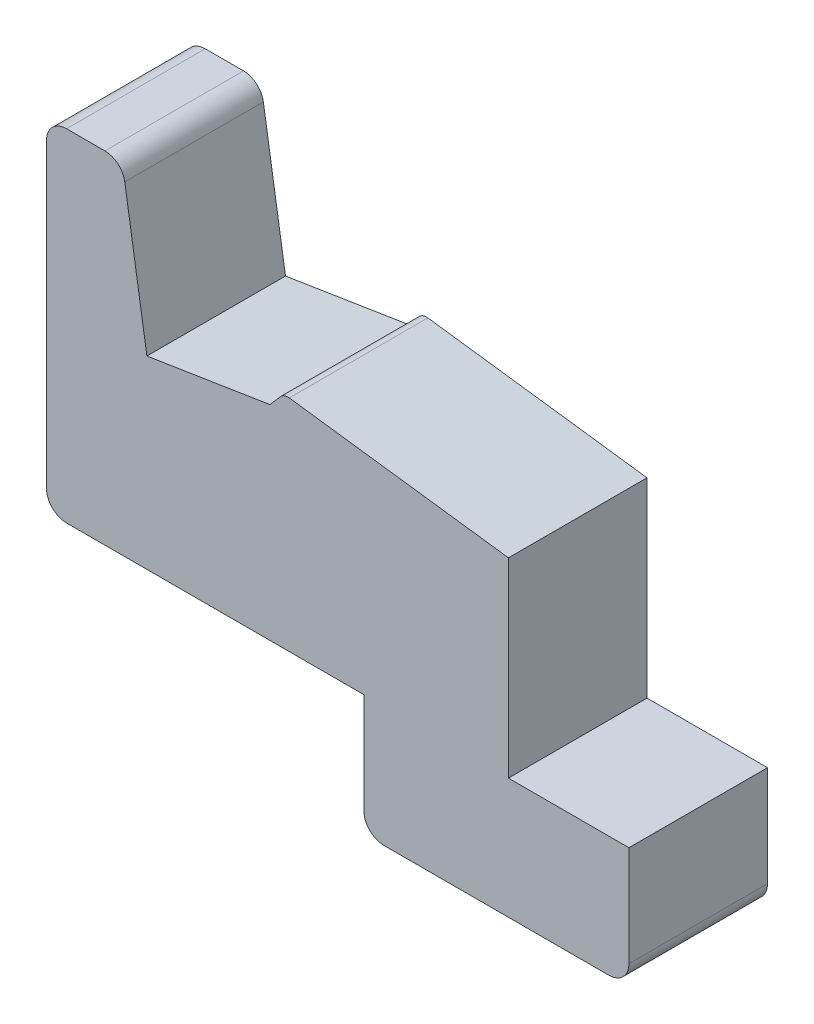
ISO-10303-21;
HEADER;
FILE_DESCRIPTION(('STEP AP214'),'2;1');
FILE_NAME('part.step','',(''),(''),'','','');
FILE_SCHEMA(('AUTOMOTIVE_DESIGN { 1 0 10303 214 1 1 1 1 }'));
ENDSEC;
DATA;
#1=APPLICATION_CONTEXT('core data for automotive mechanical design processes');
#2=APPLICATION_PROTOCOL_DEFINITION('international standard','automotive_design',2000,#1);
#3=PRODUCT_CONTEXT('',#1,'mechanical');
#4=PRODUCT('Part','Part','',(#3));
#5=PRODUCT_RELATED_PRODUCT_CATEGORY('part','',(#4));
#6=PRODUCT_DEFINITION_FORMATION('','',#4);
#7=PRODUCT_DEFINITION_CONTEXT('part definition',#1,'design');
#8=PRODUCT_DEFINITION('design','',#6,#7);
#9=PRODUCT_DEFINITION_SHAPE('','',#8);
#10=(LENGTH_UNIT() NAMED_UNIT(*) SI_UNIT(.MILLI.,.METRE.));
#11=(NAMED_UNIT(*) PLANE_ANGLE_UNIT() SI_UNIT($,.RADIAN.));
#12=(NAMED_UNIT(*) SI_UNIT($,.STERADIAN.) SOLID_ANGLE_UNIT());
#13=UNCERTAINTY_MEASURE_WITH_UNIT(LENGTH_MEASURE(1.E-05),#10,'distance_accuracy_value','');
#14=(GEOMETRIC_REPRESENTATION_CONTEXT(3) GLOBAL_UNCERTAINTY_ASSIGNED_CONTEXT((#13)) GLOBAL_UNIT_ASSIGNED_CONTEXT((#10,
#11,#12)) REPRESENTATION_CONTEXT('',''));
#15=CARTESIAN_POINT('',(0.,0.,0.));
#16=DIRECTION('',(0.,0.,1.));
#17=DIRECTION('',(1.,0.,0.));
#18=AXIS2_PLACEMENT_3D('',#15,#16,#17);
#19=CARTESIAN_POINT('',(-11.5,8.5,6.9));
#20=DIRECTION('',(1.,0.,0.));
#21=DIRECTION('',(0.,1.,0.));
#22=AXIS2_PLACEMENT_3D('',#19,#20,#21);
#23=PLANE('',#22);
#24=DIRECTION('',(0.,-1.,0.));
#25=VECTOR('',#24,1.);
#26=CARTESIAN_POINT('',(-11.5,8.5,6.9));
#27=LINE('',#26,#25);
#28=CARTESIAN_POINT('',(-11.5,7.5,6.9));
#29=VERTEX_POINT('',#28);
#30=CARTESIAN_POINT('',(-11.5,-7.5,6.9));
#31=VERTEX_POINT('',#30);
#32=EDGE_CURVE('E367',#29,#31,#27,.T.);
#33=ORIENTED_EDGE('',*,*,#32,.F.);
#34=DIRECTION('',(0.,0.,-1.));
#35=VECTOR('',#34,1.);
#36=CARTESIAN_POINT('',(-11.5,7.5,6.9));
#37=LINE('',#36,#35);
#38=CARTESIAN_POINT('',(-11.5,7.5,0.));
#39=VERTEX_POINT('',#38);
#40=EDGE_CURVE('E282',#29,#39,#37,.T.);
#41=ORIENTED_EDGE('',*,*,#40,.T.);
#42=DIRECTION('',(0.,-1.,0.));
#43=VECTOR('',#42,1.);
#44=CARTESIAN_POINT('',(-11.5,8.5,0.));
#45=LINE('',#44,#43);
#46=CARTESIAN_POINT('',(-11.5,-7.5,0.));
#47=VERTEX_POINT('',#46);
#48=EDGE_CURVE('E210',#39,#47,#45,.T.);
#49=ORIENTED_EDGE('',*,*,#48,.T.);
#50=DIRECTION('',(0.,0.,-1.));
#51=VECTOR('',#50,1.);
#52=CARTESIAN_POINT('',(-11.5,-7.5,6.9));
#53=LINE('',#52,#51);
#54=EDGE_CURVE('E383',#47,#31,#53,.F.);
#55=ORIENTED_EDGE('',*,*,#54,.T.);
#56=EDGE_LOOP('',(#33,#41,#49,#55));
#57=FACE_BOUND('',#56,.T.);
#58=ADVANCED_FACE('F38',(#57),#23,.F.);
#59=CARTESIAN_POINT('',(11.5,-8.49999999999999,6.9));
#60=DIRECTION('',(0.,1.,0.));
#61=DIRECTION('',(-1.,0.,0.));
#62=AXIS2_PLACEMENT_3D('',#59,#60,#61);
#63=PLANE('',#62);
#64=DIRECTION('',(1.,0.,0.));
#65=VECTOR('',#64,1.);
#66=CARTESIAN_POINT('',(11.5,-8.49999999999999,6.9));
#67=LINE('',#66,#65);
#68=CARTESIAN_POINT('',(-10.5,-8.5,6.9));
#69=VERTEX_POINT('',#68);
#70=CARTESIAN_POINT('',(4.3,-8.5,6.9));
#71=VERTEX_POINT('',#70);
#72=EDGE_CURVE('E291',#69,#71,#67,.T.);
#73=ORIENTED_EDGE('',*,*,#72,.F.);
#74=DIRECTION('',(0.,0.,-1.));
#75=VECTOR('',#74,1.);
#76=CARTESIAN_POINT('',(-10.5,-8.5,6.9));
#77=LINE('',#76,#75);
#78=CARTESIAN_POINT('',(-10.5,-8.5,0.));
#79=VERTEX_POINT('',#78);
#80=EDGE_CURVE('E11',#69,#79,#77,.T.);
#81=ORIENTED_EDGE('',*,*,#80,.T.);
#82=DIRECTION('',(1.,0.,0.));
#83=VECTOR('',#82,1.);
#84=CARTESIAN_POINT('',(11.5,-8.49999999999999,0.));
#85=LINE('',#84,#83);
#86=CARTESIAN_POINT('',(4.3,-8.5,0.));
#87=VERTEX_POINT('',#86);
#88=EDGE_CURVE('E200',#79,#87,#85,.T.);
#89=ORIENTED_EDGE('',*,*,#88,.T.);
#90=DIRECTION('',(0.,0.,1.));
#91=VECTOR('',#90,1.);
#92=CARTESIAN_POINT('',(4.3,-8.5,-14.4996551683135));
#93=LINE('',#92,#91);
#94=EDGE_CURVE('E205',#87,#71,#93,.T.);
#95=ORIENTED_EDGE('',*,*,#94,.T.);
#96=EDGE_LOOP('',(#73,#81,#89,#95));
#97=FACE_BOUND('',#96,.T.);
#98=ADVANCED_FACE('F203',(#97),#63,.F.);
#99=CARTESIAN_POINT('',(11.5,8.50000000000001,6.9));
#100=DIRECTION('',(-1.,0.,0.));
#101=DIRECTION('',(0.,-1.,0.));
#102=AXIS2_PLACEMENT_3D('',#99,#100,#101);
#103=PLANE('',#102);
#104=DIRECTION('',(0.,1.,0.));
#105=VECTOR('',#104,1.);
#106=CARTESIAN_POINT('',(11.5,8.50000000000001,0.));
#107=LINE('',#106,#105);
#108=CARTESIAN_POINT('',(11.5,-8.5,0.));
#109=VERTEX_POINT('',#108);
#110=CARTESIAN_POINT('',(11.5,1.,0.));
#111=VERTEX_POINT('',#110);
#112=EDGE_CURVE('E209',#109,#111,#107,.T.);
#113=ORIENTED_EDGE('',*,*,#112,.T.);
#114=DIRECTION('',(0.,0.,-1.));
#115=VECTOR('',#114,1.);
#116=CARTESIAN_POINT('',(11.5,1.,62.5890617273248));
#117=LINE('',#116,#115);
#118=CARTESIAN_POINT('',(11.5,1.,6.9));
#119=VERTEX_POINT('',#118);
#120=EDGE_CURVE('E420',#119,#111,#117,.T.);
#121=ORIENTED_EDGE('',*,*,#120,.F.);
#122=DIRECTION('',(0.,1.,0.));
#123=VECTOR('',#122,1.);
#124=CARTESIAN_POINT('',(11.5,8.50000000000001,6.9));
#125=LINE('',#124,#123);
#126=CARTESIAN_POINT('',(11.5,-8.5,6.9));
#127=VERTEX_POINT('',#126);
#128=EDGE_CURVE('E316',#127,#119,#125,.T.);
#129=ORIENTED_EDGE('',*,*,#128,.F.);
#130=DIRECTION('',(0.,0.,-1.));
#131=VECTOR('',#130,1.);
#132=CARTESIAN_POINT('',(11.5,-8.49999999999999,6.9));
#133=LINE('',#132,#131);
#134=EDGE_CURVE('E304',#127,#109,#133,.T.);
#135=ORIENTED_EDGE('',*,*,#134,.T.);
#136=EDGE_LOOP('',(#113,#121,#129,#135));
#137=FACE_BOUND('',#136,.T.);
#138=ADVANCED_FACE('F439',(#137),#103,.F.);
#139=CARTESIAN_POINT('',(11.5,8.50000000000001,6.9));
#140=DIRECTION('',(0.,-1.,0.));
#141=DIRECTION('',(1.,0.,0.));
#142=AXIS2_PLACEMENT_3D('',#139,#140,#141);
#143=PLANE('',#142);
#144=DIRECTION('',(-1.,0.,0.));
#145=VECTOR('',#144,1.);
#146=CARTESIAN_POINT('',(11.5,8.50000000000001,6.9));
#147=LINE('',#146,#145);
#148=CARTESIAN_POINT('',(-8.5894793199948,8.5,6.9));
#149=VERTEX_POINT('',#148);
#150=CARTESIAN_POINT('',(-10.5,8.5,6.9));
#151=VERTEX_POINT('',#150);
#152=EDGE_CURVE('E309',#149,#151,#147,.T.);
#153=ORIENTED_EDGE('',*,*,#152,.F.);
#154=DIRECTION('',(0.,0.,-1.));
#155=VECTOR('',#154,1.);
#156=CARTESIAN_POINT('',(-8.5894793199948,8.5,6.9));
#157=LINE('',#156,#155);
#158=CARTESIAN_POINT('',(-8.5894793199948,8.5,0.));
#159=VERTEX_POINT('',#158);
#160=EDGE_CURVE('E352',#149,#159,#157,.T.);
#161=ORIENTED_EDGE('',*,*,#160,.T.);
#162=DIRECTION('',(-1.,0.,0.));
#163=VECTOR('',#162,1.);
#164=CARTESIAN_POINT('',(11.5,8.50000000000001,0.));
#165=LINE('',#164,#163);
#166=CARTESIAN_POINT('',(-10.5,8.5,0.));
#167=VERTEX_POINT('',#166);
#168=EDGE_CURVE('E301',#159,#167,#165,.T.);
#169=ORIENTED_EDGE('',*,*,#168,.T.);
#170=DIRECTION('',(0.,0.,-1.));
#171=VECTOR('',#170,1.);
#172=CARTESIAN_POINT('',(-10.5,8.5,6.9));
#173=LINE('',#172,#171);
#174=EDGE_CURVE('E349',#167,#151,#173,.F.);
#175=ORIENTED_EDGE('',*,*,#174,.T.);
#176=EDGE_LOOP('',(#153,#161,#169,#175));
#177=FACE_BOUND('',#176,.T.);
#178=ADVANCED_FACE('F425',(#177),#143,.F.);
#179=CARTESIAN_POINT('',(0.,0.,6.9));
#180=DIRECTION('',(0.,0.,-1.));
#181=DIRECTION('',(-1.,0.,0.));
#182=AXIS2_PLACEMENT_3D('',#179,#180,#181);
#183=PLANE('',#182);
#184=DIRECTION('',(-0.156434465040224,0.987688340595139,0.));
#185=VECTOR('',#184,1.);
#186=CARTESIAN_POINT('',(-6.23277772992803,-0.987175012421843,6.9));
#187=LINE('',#186,#185);
#188=CARTESIAN_POINT('',(-6.5,0.700000000000001,6.9));
#189=VERTEX_POINT('',#188);
#190=CARTESIAN_POINT('',(-7.60179097939966,7.65643446504023,6.9));
#191=VERTEX_POINT('',#190);
#192=EDGE_CURVE('E412',#189,#191,#187,.T.);
#193=ORIENTED_EDGE('',*,*,#192,.T.);
#194=CARTESIAN_POINT('',(-8.5894793199948,7.5,6.9));
#195=DIRECTION('',(0.,0.,-1.));
#196=DIRECTION('',(-1.,0.,0.));
#197=AXIS2_PLACEMENT_3D('',#194,#195,#196);
#198=CIRCLE('',#197,1.);
#199=EDGE_CURVE('E380',#191,#149,#198,.F.);
#200=ORIENTED_EDGE('',*,*,#199,.T.);
#201=ORIENTED_EDGE('',*,*,#152,.T.);
#202=CARTESIAN_POINT('',(-10.5,7.5,6.9));
#203=DIRECTION('',(0.,0.,-1.));
#204=DIRECTION('',(-1.,0.,0.));
#205=AXIS2_PLACEMENT_3D('',#202,#203,#204);
#206=CIRCLE('',#205,1.);
#207=EDGE_CURVE('E378',#151,#29,#206,.F.);
#208=ORIENTED_EDGE('',*,*,#207,.T.);
#209=ORIENTED_EDGE('',*,*,#32,.T.);
#210=CARTESIAN_POINT('',(-10.5,-7.5,6.9));
#211=DIRECTION('',(0.,0.,-1.));
#212=DIRECTION('',(-1.,0.,0.));
#213=AXIS2_PLACEMENT_3D('',#210,#211,#212);
#214=CIRCLE('',#213,1.);
#215=EDGE_CURVE('E374',#31,#69,#214,.F.);
#216=ORIENTED_EDGE('',*,*,#215,.T.);
#217=ORIENTED_EDGE('',*,*,#72,.T.);
#218=DIRECTION('',(0.,-1.,0.));
#219=VECTOR('',#218,1.);
#220=CARTESIAN_POINT('',(4.3,-8.5,6.9));
#221=LINE('',#220,#219);
#222=CARTESIAN_POINT('',(4.3,-13.5,6.9));
#223=VERTEX_POINT('',#222);
#224=EDGE_CURVE('E228',#71,#223,#221,.T.);
#225=ORIENTED_EDGE('',*,*,#224,.T.);
#226=CARTESIAN_POINT('',(5.3,-13.5,6.9));
#227=DIRECTION('',(0.,0.,-1.));
#228=DIRECTION('',(-1.,0.,0.));
#229=AXIS2_PLACEMENT_3D('',#226,#227,#228);
#230=CIRCLE('',#229,1.);
#231=CARTESIAN_POINT('',(5.3,-14.5,6.9));
#232=VERTEX_POINT('',#231);
#233=EDGE_CURVE('E290',#223,#232,#230,.F.);
#234=ORIENTED_EDGE('',*,*,#233,.T.);
#235=DIRECTION('',(1.,0.,0.));
#236=VECTOR('',#235,1.);
#237=CARTESIAN_POINT('',(17.5,-14.5,6.9));
#238=LINE('',#237,#236);
#239=CARTESIAN_POINT('',(16.5,-14.5,6.9));
#240=VERTEX_POINT('',#239);
#241=EDGE_CURVE('E234',#232,#240,#238,.T.);
#242=ORIENTED_EDGE('',*,*,#241,.T.);
#243=CARTESIAN_POINT('',(16.5,-13.5,6.9));
#244=DIRECTION('',(0.,0.,-1.));
#245=DIRECTION('',(-1.,0.,0.));
#246=AXIS2_PLACEMENT_3D('',#243,#244,#245);
#247=CIRCLE('',#246,1.);
#248=CARTESIAN_POINT('',(17.5,-13.5,6.9));
#249=VERTEX_POINT('',#248);
#250=EDGE_CURVE('E57',#240,#249,#247,.F.);
#251=ORIENTED_EDGE('',*,*,#250,.T.);
#252=DIRECTION('',(0.,1.,0.));
#253=VECTOR('',#252,1.);
#254=CARTESIAN_POINT('',(17.5,-8.5,6.9));
#255=LINE('',#254,#253);
#256=CARTESIAN_POINT('',(17.5,-8.5,6.9));
#257=VERTEX_POINT('',#256);
#258=EDGE_CURVE('E256',#249,#257,#255,.T.);
#259=ORIENTED_EDGE('',*,*,#258,.T.);
#260=DIRECTION('',(-1.,0.,0.));
#261=VECTOR('',#260,1.);
#262=CARTESIAN_POINT('',(17.5,-8.5,6.9));
#263=LINE('',#262,#261);
#264=EDGE_CURVE('E251',#257,#127,#263,.T.);
#265=ORIENTED_EDGE('',*,*,#264,.T.);
#266=ORIENTED_EDGE('',*,*,#128,.T.);
#267=DIRECTION('',(-0.991427261327905,0.130659808265013,0.));
#268=VECTOR('',#267,1.);
#269=CARTESIAN_POINT('',(0.325867529076084,2.47263451705297,6.9));
#270=LINE('',#269,#268);
#271=CARTESIAN_POINT('',(0.588330279591154,2.43804465454196,6.9));
#272=VERTEX_POINT('',#271);
#273=EDGE_CURVE('E618',#119,#272,#270,.T.);
#274=ORIENTED_EDGE('',*,*,#273,.T.);
#275=CARTESIAN_POINT('',(0.523000375458647,1.942331023878,6.9));
#276=DIRECTION('',(0.,0.,-1.));
#277=DIRECTION('',(-1.,0.,0.));
#278=AXIS2_PLACEMENT_3D('',#275,#276,#277);
#279=CIRCLE('',#278,0.5);
#280=CARTESIAN_POINT('',(0.145645585347263,2.27036053837326,6.9));
#281=VERTEX_POINT('',#280);
#282=EDGE_CURVE('E346',#272,#281,#279,.F.);
#283=ORIENTED_EDGE('',*,*,#282,.T.);
#284=DIRECTION('',(-0.656059028990511,-0.754709580222769,0.));
#285=VECTOR('',#284,1.);
#286=CARTESIAN_POINT('',(-1.04117500629039,0.90507962471397,6.9));
#287=LINE('',#286,#285);
#288=CARTESIAN_POINT('',(-0.376332288310136,1.66989368324939,6.9));
#289=VERTEX_POINT('',#288);
#290=EDGE_CURVE('E630',#281,#289,#287,.T.);
#291=ORIENTED_EDGE('',*,*,#290,.T.);
#292=DIRECTION('',(-0.987688340595139,-0.156434465040224,0.));
#293=VECTOR('',#292,1.);
#294=CARTESIAN_POINT('',(-0.267222270071965,1.68717501242184,6.9));
#295=LINE('',#294,#293);
#296=EDGE_CURVE('E418',#289,#189,#295,.T.);
#297=ORIENTED_EDGE('',*,*,#296,.T.);
#298=EDGE_LOOP('',(#193,#200,#201,#208,#209,#216,#217,#225,#234,#242,#251,#259,#265,#266,#274,
#283,#291,#297));
#299=FACE_BOUND('',#298,.T.);
#300=ADVANCED_FACE('F289',(#299),#183,.F.);
#301=CARTESIAN_POINT('',(0.,0.,0.));
#302=DIRECTION('',(0.,0.,-1.));
#303=DIRECTION('',(-1.,0.,0.));
#304=AXIS2_PLACEMENT_3D('',#301,#302,#303);
#305=PLANE('',#304);
#306=ORIENTED_EDGE('',*,*,#168,.F.);
#307=CARTESIAN_POINT('',(-8.5894793199948,7.5,0.));
#308=DIRECTION('',(0.,0.,-1.));
#309=DIRECTION('',(-1.,0.,0.));
#310=AXIS2_PLACEMENT_3D('',#307,#308,#309);
#311=CIRCLE('',#310,1.);
#312=CARTESIAN_POINT('',(-7.60179097939966,7.65643446504023,0.));
#313=VERTEX_POINT('',#312);
#314=EDGE_CURVE('E403',#159,#313,#311,.T.);
#315=ORIENTED_EDGE('',*,*,#314,.T.);
#316=DIRECTION('',(-0.156434465040224,0.987688340595139,0.));
#317=VECTOR('',#316,1.);
#318=CARTESIAN_POINT('',(-6.23277772992803,-0.987175012421843,0.));
#319=LINE('',#318,#317);
#320=CARTESIAN_POINT('',(-6.5,0.700000000000001,0.));
#321=VERTEX_POINT('',#320);
#322=EDGE_CURVE('E308',#321,#313,#319,.T.);
#323=ORIENTED_EDGE('',*,*,#322,.F.);
#324=DIRECTION('',(-0.987688340595139,-0.156434465040224,0.));
#325=VECTOR('',#324,1.);
#326=CARTESIAN_POINT('',(-0.267222270071965,1.68717501242184,0.));
#327=LINE('',#326,#325);
#328=CARTESIAN_POINT('',(-0.376332288310136,1.66989368324939,0.));
#329=VERTEX_POINT('',#328);
#330=EDGE_CURVE('E325',#329,#321,#327,.T.);
#331=ORIENTED_EDGE('',*,*,#330,.F.);
#332=DIRECTION('',(-0.656059028990511,-0.754709580222769,0.));
#333=VECTOR('',#332,1.);
#334=CARTESIAN_POINT('',(-1.04117500629039,0.90507962471397,0.));
#335=LINE('',#334,#333);
#336=CARTESIAN_POINT('',(0.145645585347263,2.27036053837326,0.));
#337=VERTEX_POINT('',#336);
#338=EDGE_CURVE('E329',#337,#329,#335,.T.);
#339=ORIENTED_EDGE('',*,*,#338,.F.);
#340=CARTESIAN_POINT('',(0.523000375458647,1.942331023878,0.));
#341=DIRECTION('',(0.,0.,-1.));
#342=DIRECTION('',(-1.,0.,0.));
#343=AXIS2_PLACEMENT_3D('',#340,#341,#342);
#344=CIRCLE('',#343,0.5);
#345=CARTESIAN_POINT('',(0.588330279591154,2.43804465454196,0.));
#346=VERTEX_POINT('',#345);
#347=EDGE_CURVE('E340',#337,#346,#344,.T.);
#348=ORIENTED_EDGE('',*,*,#347,.T.);
#349=DIRECTION('',(-0.991427261327905,0.130659808265013,0.));
#350=VECTOR('',#349,1.);
#351=CARTESIAN_POINT('',(0.325867529076084,2.47263451705297,0.));
#352=LINE('',#351,#350);
#353=EDGE_CURVE('E332',#111,#346,#352,.T.);
#354=ORIENTED_EDGE('',*,*,#353,.F.);
#355=ORIENTED_EDGE('',*,*,#112,.F.);
#356=DIRECTION('',(-1.,0.,0.));
#357=VECTOR('',#356,1.);
#358=CARTESIAN_POINT('',(17.5,-8.5,0.));
#359=LINE('',#358,#357);
#360=CARTESIAN_POINT('',(17.5,-8.5,0.));
#361=VERTEX_POINT('',#360);
#362=EDGE_CURVE('E230',#361,#109,#359,.T.);
#363=ORIENTED_EDGE('',*,*,#362,.F.);
#364=DIRECTION('',(0.,1.,0.));
#365=VECTOR('',#364,1.);
#366=CARTESIAN_POINT('',(17.5,-8.5,0.));
#367=LINE('',#366,#365);
#368=CARTESIAN_POINT('',(17.5,-13.5,0.));
#369=VERTEX_POINT('',#368);
#370=EDGE_CURVE('E248',#369,#361,#367,.T.);
#371=ORIENTED_EDGE('',*,*,#370,.F.);
#372=CARTESIAN_POINT('',(16.5,-13.5,0.));
#373=DIRECTION('',(0.,0.,-1.));
#374=DIRECTION('',(-1.,0.,0.));
#375=AXIS2_PLACEMENT_3D('',#372,#373,#374);
#376=CIRCLE('',#375,1.);
#377=CARTESIAN_POINT('',(16.5,-14.5,0.));
#378=VERTEX_POINT('',#377);
#379=EDGE_CURVE('E275',#369,#378,#376,.T.);
#380=ORIENTED_EDGE('',*,*,#379,.T.);
#381=DIRECTION('',(1.,0.,0.));
#382=VECTOR('',#381,1.);
#383=CARTESIAN_POINT('',(17.5,-14.5,0.));
#384=LINE('',#383,#382);
#385=CARTESIAN_POINT('',(5.3,-14.5,0.));
#386=VERTEX_POINT('',#385);
#387=EDGE_CURVE('E223',#386,#378,#384,.T.);
#388=ORIENTED_EDGE('',*,*,#387,.F.);
#389=CARTESIAN_POINT('',(5.3,-13.5,0.));
#390=DIRECTION('',(0.,0.,-1.));
#391=DIRECTION('',(-1.,0.,0.));
#392=AXIS2_PLACEMENT_3D('',#389,#390,#391);
#393=CIRCLE('',#392,1.);
#394=CARTESIAN_POINT('',(4.3,-13.5,0.));
#395=VERTEX_POINT('',#394);
#396=EDGE_CURVE('E218',#386,#395,#393,.T.);
#397=ORIENTED_EDGE('',*,*,#396,.T.);
#398=DIRECTION('',(0.,-1.,0.));
#399=VECTOR('',#398,1.);
#400=CARTESIAN_POINT('',(4.3,-8.5,0.));
#401=LINE('',#400,#399);
#402=EDGE_CURVE('E213',#87,#395,#401,.T.);
#403=ORIENTED_EDGE('',*,*,#402,.F.);
#404=ORIENTED_EDGE('',*,*,#88,.F.);
#405=CARTESIAN_POINT('',(-10.5,-7.5,0.));
#406=DIRECTION('',(0.,0.,-1.));
#407=DIRECTION('',(-1.,0.,0.));
#408=AXIS2_PLACEMENT_3D('',#405,#406,#407);
#409=CIRCLE('',#408,1.);
#410=EDGE_CURVE('E355',#79,#47,#409,.T.);
#411=ORIENTED_EDGE('',*,*,#410,.T.);
#412=ORIENTED_EDGE('',*,*,#48,.F.);
#413=CARTESIAN_POINT('',(-10.5,7.5,0.));
#414=DIRECTION('',(0.,0.,-1.));
#415=DIRECTION('',(-1.,0.,0.));
#416=AXIS2_PLACEMENT_3D('',#413,#414,#415);
#417=CIRCLE('',#416,1.);
#418=EDGE_CURVE('E397',#39,#167,#417,.T.);
#419=ORIENTED_EDGE('',*,*,#418,.T.);
#420=EDGE_LOOP('',(#306,#315,#323,#331,#339,#348,#354,#355,#363,#371,#380,#388,#397,#403,#404,
#411,#412,#419));
#421=FACE_BOUND('',#420,.T.);
#422=ADVANCED_FACE('F215',(#421),#305,.T.);
#423=CARTESIAN_POINT('',(17.5,-8.5,-14.4996551683135));
#424=DIRECTION('',(0.,1.,0.));
#425=DIRECTION('',(-1.,0.,0.));
#426=AXIS2_PLACEMENT_3D('',#423,#424,#425);
#427=PLANE('',#426);
#428=ORIENTED_EDGE('',*,*,#134,.F.);
#429=ORIENTED_EDGE('',*,*,#264,.F.);
#430=DIRECTION('',(0.,0.,1.));
#431=VECTOR('',#430,1.);
#432=CARTESIAN_POINT('',(17.5,-8.5,-14.4996551683135));
#433=LINE('',#432,#431);
#434=EDGE_CURVE('E245',#361,#257,#433,.T.);
#435=ORIENTED_EDGE('',*,*,#434,.F.);
#436=ORIENTED_EDGE('',*,*,#362,.T.);
#437=EDGE_LOOP('',(#428,#429,#435,#436));
#438=FACE_BOUND('',#437,.T.);
#439=ADVANCED_FACE('F543',(#438),#427,.T.);
#440=CARTESIAN_POINT('',(4.3,-8.5,-14.4996551683135));
#441=DIRECTION('',(-1.,0.,0.));
#442=DIRECTION('',(0.,-1.,0.));
#443=AXIS2_PLACEMENT_3D('',#440,#441,#442);
#444=PLANE('',#443);
#445=ORIENTED_EDGE('',*,*,#402,.T.);
#446=DIRECTION('',(0.,0.,1.));
#447=VECTOR('',#446,1.);
#448=CARTESIAN_POINT('',(4.3,-13.5,-14.4996551683135));
#449=LINE('',#448,#447);
#450=EDGE_CURVE('E47',#395,#223,#449,.T.);
#451=ORIENTED_EDGE('',*,*,#450,.T.);
#452=ORIENTED_EDGE('',*,*,#224,.F.);
#453=ORIENTED_EDGE('',*,*,#94,.F.);
#454=EDGE_LOOP('',(#445,#451,#452,#453));
#455=FACE_BOUND('',#454,.T.);
#456=ADVANCED_FACE('F226',(#455),#444,.T.);
#457=CARTESIAN_POINT('',(17.5,-14.5,-14.4996551683135));
#458=DIRECTION('',(0.,-1.,0.));
#459=DIRECTION('',(1.,0.,0.));
#460=AXIS2_PLACEMENT_3D('',#457,#458,#459);
#461=PLANE('',#460);
#462=ORIENTED_EDGE('',*,*,#387,.T.);
#463=DIRECTION('',(0.,0.,1.));
#464=VECTOR('',#463,1.);
#465=CARTESIAN_POINT('',(16.5,-14.5,-14.4996551683135));
#466=LINE('',#465,#464);
#467=EDGE_CURVE('E270',#378,#240,#466,.T.);
#468=ORIENTED_EDGE('',*,*,#467,.T.);
#469=ORIENTED_EDGE('',*,*,#241,.F.);
#470=DIRECTION('',(0.,0.,1.));
#471=VECTOR('',#470,1.);
#472=CARTESIAN_POINT('',(5.3,-14.5,-14.4996551683135));
#473=LINE('',#472,#471);
#474=EDGE_CURVE('E272',#232,#386,#473,.F.);
#475=ORIENTED_EDGE('',*,*,#474,.T.);
#476=EDGE_LOOP('',(#462,#468,#469,#475));
#477=FACE_BOUND('',#476,.T.);
#478=ADVANCED_FACE('F268',(#477),#461,.T.);
#479=CARTESIAN_POINT('',(17.5,-8.5,-14.4996551683135));
#480=DIRECTION('',(1.,0.,0.));
#481=DIRECTION('',(0.,0.,-1.));
#482=AXIS2_PLACEMENT_3D('',#479,#480,#481);
#483=PLANE('',#482);
#484=ORIENTED_EDGE('',*,*,#258,.F.);
#485=DIRECTION('',(0.,0.,1.));
#486=VECTOR('',#485,1.);
#487=CARTESIAN_POINT('',(17.5,-13.5,-14.4996551683135));
#488=LINE('',#487,#486);
#489=EDGE_CURVE('E277',#249,#369,#488,.F.);
#490=ORIENTED_EDGE('',*,*,#489,.T.);
#491=ORIENTED_EDGE('',*,*,#370,.T.);
#492=ORIENTED_EDGE('',*,*,#434,.T.);
#493=EDGE_LOOP('',(#484,#490,#491,#492));
#494=FACE_BOUND('',#493,.T.);
#495=ADVANCED_FACE('F520',(#494),#483,.T.);
#496=CARTESIAN_POINT('',(11.5,1.,62.5890617273248));
#497=DIRECTION('',(-0.130659808265013,-0.991427261327905,0.));
#498=DIRECTION('',(0.991427261327905,-0.130659808265013,0.));
#499=AXIS2_PLACEMENT_3D('',#496,#497,#498);
#500=PLANE('',#499);
#501=ORIENTED_EDGE('',*,*,#353,.T.);
#502=DIRECTION('',(0.,0.,-1.));
#503=VECTOR('',#502,1.);
#504=CARTESIAN_POINT('',(0.588330279591156,2.43804465454196,62.5890617273248));
#505=LINE('',#504,#503);
#506=EDGE_CURVE('E343',#346,#272,#505,.F.);
#507=ORIENTED_EDGE('',*,*,#506,.T.);
#508=ORIENTED_EDGE('',*,*,#273,.F.);
#509=ORIENTED_EDGE('',*,*,#120,.T.);
#510=EDGE_LOOP('',(#501,#507,#508,#509));
#511=FACE_BOUND('',#510,.T.);
#512=ADVANCED_FACE('F512',(#511),#500,.F.);
#513=CARTESIAN_POINT('',(0.321930688514025,2.47315335172,62.5890617273248));
#514=DIRECTION('',(0.754709580222769,-0.656059028990511,0.));
#515=DIRECTION('',(0.656059028990511,0.754709580222769,0.));
#516=AXIS2_PLACEMENT_3D('',#513,#514,#515);
#517=PLANE('',#516);
#518=ORIENTED_EDGE('',*,*,#290,.F.);
#519=DIRECTION('',(0.,0.,-1.));
#520=VECTOR('',#519,1.);
#521=CARTESIAN_POINT('',(0.145645585347263,2.27036053837326,62.5890617273248));
#522=LINE('',#521,#520);
#523=EDGE_CURVE('E336',#281,#337,#522,.T.);
#524=ORIENTED_EDGE('',*,*,#523,.T.);
#525=ORIENTED_EDGE('',*,*,#338,.T.);
#526=DIRECTION('',(0.,0.,-1.));
#527=VECTOR('',#526,1.);
#528=CARTESIAN_POINT('',(-0.376332288310136,1.66989368324939,62.5890617273248));
#529=LINE('',#528,#527);
#530=EDGE_CURVE('E620',#289,#329,#529,.T.);
#531=ORIENTED_EDGE('',*,*,#530,.F.);
#532=EDGE_LOOP('',(#518,#524,#525,#531));
#533=FACE_BOUND('',#532,.T.);
#534=ADVANCED_FACE('F502',(#533),#517,.F.);
#535=CARTESIAN_POINT('',(-0.376332288310136,1.66989368324939,62.5890617273248));
#536=DIRECTION('',(0.156434465040224,-0.987688340595139,0.));
#537=DIRECTION('',(0.987688340595139,0.156434465040224,0.));
#538=AXIS2_PLACEMENT_3D('',#535,#536,#537);
#539=PLANE('',#538);
#540=ORIENTED_EDGE('',*,*,#296,.F.);
#541=ORIENTED_EDGE('',*,*,#530,.T.);
#542=ORIENTED_EDGE('',*,*,#330,.T.);
#543=DIRECTION('',(0.,0.,-1.));
#544=VECTOR('',#543,1.);
#545=CARTESIAN_POINT('',(-6.5,0.700000000000001,62.5890617273248));
#546=LINE('',#545,#544);
#547=EDGE_CURVE('E625',#189,#321,#546,.T.);
#548=ORIENTED_EDGE('',*,*,#547,.F.);
#549=EDGE_LOOP('',(#540,#541,#542,#548));
#550=FACE_BOUND('',#549,.T.);
#551=ADVANCED_FACE('F493',(#550),#539,.F.);
#552=CARTESIAN_POINT('',(-6.5,0.700000000000001,62.5890617273248));
#553=DIRECTION('',(-0.987688340595139,-0.156434465040224,0.));
#554=DIRECTION('',(0.156434465040224,-0.987688340595139,0.));
#555=AXIS2_PLACEMENT_3D('',#552,#553,#554);
#556=PLANE('',#555);
#557=ORIENTED_EDGE('',*,*,#322,.T.);
#558=DIRECTION('',(0.,0.,-1.));
#559=VECTOR('',#558,1.);
#560=CARTESIAN_POINT('',(-7.60179097939966,7.65643446504023,62.5890617273248));
#561=LINE('',#560,#559);
#562=EDGE_CURVE('E372',#313,#191,#561,.F.);
#563=ORIENTED_EDGE('',*,*,#562,.T.);
#564=ORIENTED_EDGE('',*,*,#192,.F.);
#565=ORIENTED_EDGE('',*,*,#547,.T.);
#566=EDGE_LOOP('',(#557,#563,#564,#565));
#567=FACE_BOUND('',#566,.T.);
#568=ADVANCED_FACE('F410',(#567),#556,.F.);
#569=CARTESIAN_POINT('',(0.523000375458647,1.942331023878,62.5890617273248));
#570=DIRECTION('',(0.,0.,-1.));
#571=DIRECTION('',(-1.,0.,0.));
#572=AXIS2_PLACEMENT_3D('',#569,#570,#571);
#573=CYLINDRICAL_SURFACE('',#572,0.5);
#574=ORIENTED_EDGE('',*,*,#282,.F.);
#575=ORIENTED_EDGE('',*,*,#506,.F.);
#576=ORIENTED_EDGE('',*,*,#347,.F.);
#577=ORIENTED_EDGE('',*,*,#523,.F.);
#578=EDGE_LOOP('',(#574,#575,#576,#577));
#579=FACE_BOUND('',#578,.T.);
#580=ADVANCED_FACE('F443',(#579),#573,.T.);
#581=CARTESIAN_POINT('',(-8.5894793199948,7.5,6.9));
#582=DIRECTION('',(0.,0.,-1.));
#583=DIRECTION('',(-1.,0.,0.));
#584=AXIS2_PLACEMENT_3D('',#581,#582,#583);
#585=CYLINDRICAL_SURFACE('',#584,1.);
#586=ORIENTED_EDGE('',*,*,#199,.F.);
#587=ORIENTED_EDGE('',*,*,#562,.F.);
#588=ORIENTED_EDGE('',*,*,#314,.F.);
#589=ORIENTED_EDGE('',*,*,#160,.F.);
#590=EDGE_LOOP('',(#586,#587,#588,#589));
#591=FACE_BOUND('',#590,.T.);
#592=ADVANCED_FACE('F423',(#591),#585,.T.);
#593=CARTESIAN_POINT('',(-10.5,7.5,6.9));
#594=DIRECTION('',(0.,0.,-1.));
#595=DIRECTION('',(-1.,0.,0.));
#596=AXIS2_PLACEMENT_3D('',#593,#594,#595);
#597=CYLINDRICAL_SURFACE('',#596,1.);
#598=ORIENTED_EDGE('',*,*,#207,.F.);
#599=ORIENTED_EDGE('',*,*,#174,.F.);
#600=ORIENTED_EDGE('',*,*,#418,.F.);
#601=ORIENTED_EDGE('',*,*,#40,.F.);
#602=EDGE_LOOP('',(#598,#599,#600,#601));
#603=FACE_BOUND('',#602,.T.);
#604=ADVANCED_FACE('F449',(#603),#597,.T.);
#605=CARTESIAN_POINT('',(16.5,-13.5,-14.4996551683135));
#606=DIRECTION('',(0.,0.,1.));
#607=DIRECTION('',(1.,0.,0.));
#608=AXIS2_PLACEMENT_3D('',#605,#606,#607);
#609=CYLINDRICAL_SURFACE('',#608,1.);
#610=ORIENTED_EDGE('',*,*,#379,.F.);
#611=ORIENTED_EDGE('',*,*,#489,.F.);
#612=ORIENTED_EDGE('',*,*,#250,.F.);
#613=ORIENTED_EDGE('',*,*,#467,.F.);
#614=EDGE_LOOP('',(#610,#611,#612,#613));
#615=FACE_BOUND('',#614,.T.);
#616=ADVANCED_FACE('F274',(#615),#609,.T.);
#617=CARTESIAN_POINT('',(5.3,-13.5,-14.4996551683135));
#618=DIRECTION('',(0.,0.,1.));
#619=DIRECTION('',(1.,0.,0.));
#620=AXIS2_PLACEMENT_3D('',#617,#618,#619);
#621=CYLINDRICAL_SURFACE('',#620,1.);
#622=ORIENTED_EDGE('',*,*,#396,.F.);
#623=ORIENTED_EDGE('',*,*,#474,.F.);
#624=ORIENTED_EDGE('',*,*,#233,.F.);
#625=ORIENTED_EDGE('',*,*,#450,.F.);
#626=EDGE_LOOP('',(#622,#623,#624,#625));
#627=FACE_BOUND('',#626,.T.);
#628=ADVANCED_FACE('F430',(#627),#621,.T.);
#629=CARTESIAN_POINT('',(-10.5,-7.5,6.9));
#630=DIRECTION('',(0.,0.,-1.));
#631=DIRECTION('',(-1.,0.,0.));
#632=AXIS2_PLACEMENT_3D('',#629,#630,#631);
#633=CYLINDRICAL_SURFACE('',#632,1.);
#634=ORIENTED_EDGE('',*,*,#215,.F.);
#635=ORIENTED_EDGE('',*,*,#54,.F.);
#636=ORIENTED_EDGE('',*,*,#410,.F.);
#637=ORIENTED_EDGE('',*,*,#80,.F.);
#638=EDGE_LOOP('',(#634,#635,#636,#637));
#639=FACE_BOUND('',#638,.T.);
#640=ADVANCED_FACE('F40',(#639),#633,.T.);
#641=CLOSED_SHELL('',(#58,#98,#138,#178,#300,#422,#439,#456,#478,#495,#512,#534,#551,#568,#580,
#592,#604,#616,#628,#640));
#642=MANIFOLD_SOLID_BREP('B2',#641);
#643=ADVANCED_BREP_SHAPE_REPRESENTATION('',(#18,#642),#14);
#644=SHAPE_DEFINITION_REPRESENTATION(#9,#643);
ENDSEC;
END-ISO-10303-21;
